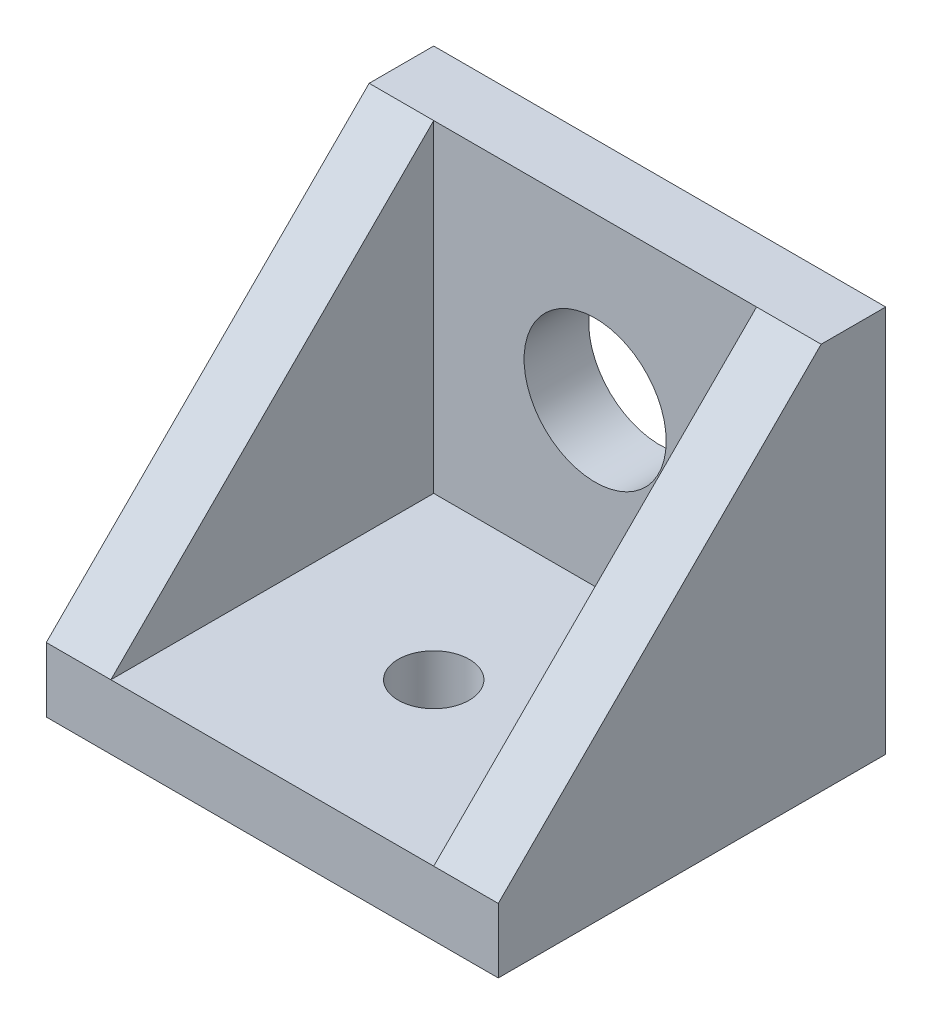
ISO-10303-21;
HEADER;
FILE_DESCRIPTION(('STEP AP214'),'2;1');
FILE_NAME('part.step','',(''),(''),'','','');
FILE_SCHEMA(('AUTOMOTIVE_DESIGN { 1 0 10303 214 1 1 1 1 }'));
ENDSEC;
DATA;
#1=APPLICATION_CONTEXT('core data for automotive mechanical design processes');
#2=APPLICATION_PROTOCOL_DEFINITION('international standard','automotive_design',2000,#1);
#3=PRODUCT_CONTEXT('',#1,'mechanical');
#4=PRODUCT('Part','Part','',(#3));
#5=PRODUCT_RELATED_PRODUCT_CATEGORY('part','',(#4));
#6=PRODUCT_DEFINITION_FORMATION('','',#4);
#7=PRODUCT_DEFINITION_CONTEXT('part definition',#1,'design');
#8=PRODUCT_DEFINITION('design','',#6,#7);
#9=PRODUCT_DEFINITION_SHAPE('','',#8);
#10=(LENGTH_UNIT() NAMED_UNIT(*) SI_UNIT(.MILLI.,.METRE.));
#11=(NAMED_UNIT(*) PLANE_ANGLE_UNIT() SI_UNIT($,.RADIAN.));
#12=(NAMED_UNIT(*) SI_UNIT($,.STERADIAN.) SOLID_ANGLE_UNIT());
#13=UNCERTAINTY_MEASURE_WITH_UNIT(LENGTH_MEASURE(1.E-05),#10,'distance_accuracy_value','');
#14=(GEOMETRIC_REPRESENTATION_CONTEXT(3) GLOBAL_UNCERTAINTY_ASSIGNED_CONTEXT((#13)) GLOBAL_UNIT_ASSIGNED_CONTEXT((#10,
#11,#12)) REPRESENTATION_CONTEXT('',''));
#15=CARTESIAN_POINT('',(0.,0.,0.));
#16=DIRECTION('',(0.,0.,1.));
#17=DIRECTION('',(1.,0.,0.));
#18=AXIS2_PLACEMENT_3D('',#15,#16,#17);
#19=CARTESIAN_POINT('',(0.,0.,3.));
#20=DIRECTION('',(0.,0.,-1.));
#21=DIRECTION('',(-1.,0.,0.));
#22=AXIS2_PLACEMENT_3D('',#19,#20,#21);
#23=PLANE('',#22);
#24=DIRECTION('',(0.,1.,0.));
#25=VECTOR('',#24,1.);
#26=CARTESIAN_POINT('',(7.5,-7.5,3.));
#27=LINE('',#26,#25);
#28=CARTESIAN_POINT('',(7.5,-7.5,3.));
#29=VERTEX_POINT('',#28);
#30=CARTESIAN_POINT('',(7.5,7.5,3.));
#31=VERTEX_POINT('',#30);
#32=EDGE_CURVE('E209',#29,#31,#27,.T.);
#33=ORIENTED_EDGE('',*,*,#32,.T.);
#34=DIRECTION('',(-1.,0.,0.));
#35=VECTOR('',#34,1.);
#36=CARTESIAN_POINT('',(-7.5,7.5,3.));
#37=LINE('',#36,#35);
#38=CARTESIAN_POINT('',(-7.5,7.5,3.));
#39=VERTEX_POINT('',#38);
#40=EDGE_CURVE('E63',#31,#39,#37,.T.);
#41=ORIENTED_EDGE('',*,*,#40,.T.);
#42=DIRECTION('',(0.,-1.,0.));
#43=VECTOR('',#42,1.);
#44=CARTESIAN_POINT('',(-7.5,-7.5,3.));
#45=LINE('',#44,#43);
#46=CARTESIAN_POINT('',(-7.5,-7.5,3.));
#47=VERTEX_POINT('',#46);
#48=EDGE_CURVE('E49',#39,#47,#45,.T.);
#49=ORIENTED_EDGE('',*,*,#48,.T.);
#50=DIRECTION('',(1.,0.,0.));
#51=VECTOR('',#50,1.);
#52=CARTESIAN_POINT('',(-7.5,-7.5,3.));
#53=LINE('',#52,#51);
#54=EDGE_CURVE('E11',#47,#29,#53,.T.);
#55=ORIENTED_EDGE('',*,*,#54,.T.);
#56=EDGE_LOOP('',(#33,#41,#49,#55));
#57=FACE_BOUND('',#56,.T.);
#58=CARTESIAN_POINT('',(0.,0.,3.));
#59=DIRECTION('',(0.,0.,1.));
#60=DIRECTION('',(1.,0.,0.));
#61=AXIS2_PLACEMENT_3D('',#58,#59,#60);
#62=CIRCLE('',#61,3.302);
#63=CARTESIAN_POINT('',(3.302,0.,3.));
#64=VERTEX_POINT('',#63);
#65=EDGE_CURVE('E202',#64,#64,#62,.T.);
#66=ORIENTED_EDGE('',*,*,#65,.F.);
#67=EDGE_LOOP('',(#66));
#68=FACE_BOUND('',#67,.T.);
#69=ADVANCED_FACE('F39',(#57,#68),#23,.F.);
#70=CARTESIAN_POINT('',(0.,0.,0.));
#71=DIRECTION('',(0.,0.,-1.));
#72=DIRECTION('',(-1.,0.,0.));
#73=AXIS2_PLACEMENT_3D('',#70,#71,#72);
#74=PLANE('',#73);
#75=DIRECTION('',(-1.,0.,0.));
#76=VECTOR('',#75,1.);
#77=CARTESIAN_POINT('',(-7.5,7.5,0.));
#78=LINE('',#77,#76);
#79=CARTESIAN_POINT('',(10.5,7.5,0.));
#80=VERTEX_POINT('',#79);
#81=CARTESIAN_POINT('',(-10.5,7.5,0.));
#82=VERTEX_POINT('',#81);
#83=EDGE_CURVE('E43',#80,#82,#78,.T.);
#84=ORIENTED_EDGE('',*,*,#83,.F.);
#85=DIRECTION('',(0.,1.,0.));
#86=VECTOR('',#85,1.);
#87=CARTESIAN_POINT('',(10.5,-10.5,0.));
#88=LINE('',#87,#86);
#89=CARTESIAN_POINT('',(10.5,-10.5,0.));
#90=VERTEX_POINT('',#89);
#91=EDGE_CURVE('E160',#90,#80,#88,.T.);
#92=ORIENTED_EDGE('',*,*,#91,.F.);
#93=DIRECTION('',(1.,0.,0.));
#94=VECTOR('',#93,1.);
#95=CARTESIAN_POINT('',(-7.5,-10.5,0.));
#96=LINE('',#95,#94);
#97=CARTESIAN_POINT('',(-10.5,-10.5,0.));
#98=VERTEX_POINT('',#97);
#99=EDGE_CURVE('E187',#98,#90,#96,.T.);
#100=ORIENTED_EDGE('',*,*,#99,.F.);
#101=DIRECTION('',(0.,1.,0.));
#102=VECTOR('',#101,1.);
#103=CARTESIAN_POINT('',(-10.5,-10.5,0.));
#104=LINE('',#103,#102);
#105=EDGE_CURVE('E133',#98,#82,#104,.T.);
#106=ORIENTED_EDGE('',*,*,#105,.T.);
#107=EDGE_LOOP('',(#84,#92,#100,#106));
#108=FACE_BOUND('',#107,.T.);
#109=CARTESIAN_POINT('',(0.,0.,0.));
#110=DIRECTION('',(0.,0.,1.));
#111=DIRECTION('',(1.,0.,0.));
#112=AXIS2_PLACEMENT_3D('',#109,#110,#111);
#113=CIRCLE('',#112,3.302);
#114=CARTESIAN_POINT('',(3.302,0.,0.));
#115=VERTEX_POINT('',#114);
#116=EDGE_CURVE('E194',#115,#115,#113,.T.);
#117=ORIENTED_EDGE('',*,*,#116,.T.);
#118=EDGE_LOOP('',(#117));
#119=FACE_BOUND('',#118,.T.);
#120=ADVANCED_FACE('F239',(#108,#119),#74,.T.);
#121=CARTESIAN_POINT('',(-7.5,7.5,3.));
#122=DIRECTION('',(0.,-1.,0.));
#123=DIRECTION('',(0.,0.,-1.));
#124=AXIS2_PLACEMENT_3D('',#121,#122,#123);
#125=PLANE('',#124);
#126=ORIENTED_EDGE('',*,*,#83,.T.);
#127=DIRECTION('',(0.,0.,1.));
#128=VECTOR('',#127,1.);
#129=CARTESIAN_POINT('',(-10.5,7.5,3.));
#130=LINE('',#129,#128);
#131=CARTESIAN_POINT('',(-10.5,7.5,3.));
#132=VERTEX_POINT('',#131);
#133=EDGE_CURVE('E124',#82,#132,#130,.T.);
#134=ORIENTED_EDGE('',*,*,#133,.T.);
#135=DIRECTION('',(1.,0.,0.));
#136=VECTOR('',#135,1.);
#137=CARTESIAN_POINT('',(-10.5,7.5,3.));
#138=LINE('',#137,#136);
#139=EDGE_CURVE('E108',#132,#39,#138,.T.);
#140=ORIENTED_EDGE('',*,*,#139,.T.);
#141=ORIENTED_EDGE('',*,*,#40,.F.);
#142=DIRECTION('',(-1.,0.,0.));
#143=VECTOR('',#142,1.);
#144=CARTESIAN_POINT('',(10.5,7.5,3.));
#145=LINE('',#144,#143);
#146=CARTESIAN_POINT('',(10.5,7.5,3.));
#147=VERTEX_POINT('',#146);
#148=EDGE_CURVE('E167',#147,#31,#145,.T.);
#149=ORIENTED_EDGE('',*,*,#148,.F.);
#150=DIRECTION('',(0.,0.,1.));
#151=VECTOR('',#150,1.);
#152=CARTESIAN_POINT('',(10.5,7.5,3.));
#153=LINE('',#152,#151);
#154=EDGE_CURVE('E164',#80,#147,#153,.T.);
#155=ORIENTED_EDGE('',*,*,#154,.F.);
#156=EDGE_LOOP('',(#126,#134,#140,#141,#149,#155));
#157=FACE_BOUND('',#156,.T.);
#158=ADVANCED_FACE('F41',(#157),#125,.F.);
#159=CARTESIAN_POINT('',(0.,0.,3.));
#160=DIRECTION('',(0.,0.,-1.));
#161=DIRECTION('',(-1.,0.,0.));
#162=AXIS2_PLACEMENT_3D('',#159,#160,#161);
#163=CYLINDRICAL_SURFACE('',#162,3.302);
#164=ORIENTED_EDGE('',*,*,#65,.T.);
#165=EDGE_LOOP('',(#164));
#166=FACE_BOUND('',#165,.T.);
#167=ORIENTED_EDGE('',*,*,#116,.F.);
#168=EDGE_LOOP('',(#167));
#169=FACE_BOUND('',#168,.T.);
#170=ADVANCED_FACE('F225',(#166,#169),#163,.F.);
#171=CARTESIAN_POINT('',(0.,-7.5,0.));
#172=DIRECTION('',(0.,1.,0.));
#173=DIRECTION('',(0.,0.,1.));
#174=AXIS2_PLACEMENT_3D('',#171,#172,#173);
#175=PLANE('',#174);
#176=CARTESIAN_POINT('',(0.,-7.5,10.5));
#177=DIRECTION('',(0.,-1.,0.));
#178=DIRECTION('',(0.,0.,-1.));
#179=AXIS2_PLACEMENT_3D('',#176,#177,#178);
#180=CIRCLE('',#179,1.65);
#181=CARTESIAN_POINT('',(0.,-7.5,8.85));
#182=VERTEX_POINT('',#181);
#183=EDGE_CURVE('E178',#182,#182,#180,.T.);
#184=ORIENTED_EDGE('',*,*,#183,.T.);
#185=EDGE_LOOP('',(#184));
#186=FACE_BOUND('',#185,.T.);
#187=ORIENTED_EDGE('',*,*,#54,.F.);
#188=DIRECTION('',(0.,0.,-1.));
#189=VECTOR('',#188,1.);
#190=CARTESIAN_POINT('',(-7.5,-7.5,0.));
#191=LINE('',#190,#189);
#192=CARTESIAN_POINT('',(-7.5,-7.5,18.));
#193=VERTEX_POINT('',#192);
#194=EDGE_CURVE('E183',#193,#47,#191,.T.);
#195=ORIENTED_EDGE('',*,*,#194,.F.);
#196=DIRECTION('',(-1.,0.,0.));
#197=VECTOR('',#196,1.);
#198=CARTESIAN_POINT('',(-7.5,-7.5,18.));
#199=LINE('',#198,#197);
#200=CARTESIAN_POINT('',(7.5,-7.5,18.));
#201=VERTEX_POINT('',#200);
#202=EDGE_CURVE('E191',#201,#193,#199,.T.);
#203=ORIENTED_EDGE('',*,*,#202,.F.);
#204=DIRECTION('',(0.,0.,1.));
#205=VECTOR('',#204,1.);
#206=CARTESIAN_POINT('',(7.50000000000001,-7.5,0.));
#207=LINE('',#206,#205);
#208=EDGE_CURVE('E56',#29,#201,#207,.T.);
#209=ORIENTED_EDGE('',*,*,#208,.F.);
#210=EDGE_LOOP('',(#187,#195,#203,#209));
#211=FACE_BOUND('',#210,.T.);
#212=ADVANCED_FACE('F222',(#186,#211),#175,.T.);
#213=CARTESIAN_POINT('',(0.,-10.5,0.));
#214=DIRECTION('',(0.,1.,0.));
#215=DIRECTION('',(0.,0.,1.));
#216=AXIS2_PLACEMENT_3D('',#213,#214,#215);
#217=PLANE('',#216);
#218=DIRECTION('',(-1.,0.,0.));
#219=VECTOR('',#218,1.);
#220=CARTESIAN_POINT('',(-7.5,-10.5,18.));
#221=LINE('',#220,#219);
#222=CARTESIAN_POINT('',(10.5,-10.5,18.));
#223=VERTEX_POINT('',#222);
#224=CARTESIAN_POINT('',(-10.5,-10.5,18.));
#225=VERTEX_POINT('',#224);
#226=EDGE_CURVE('E190',#223,#225,#221,.T.);
#227=ORIENTED_EDGE('',*,*,#226,.T.);
#228=DIRECTION('',(0.,0.,-1.));
#229=VECTOR('',#228,1.);
#230=CARTESIAN_POINT('',(-10.5,-10.5,0.));
#231=LINE('',#230,#229);
#232=EDGE_CURVE('E136',#225,#98,#231,.T.);
#233=ORIENTED_EDGE('',*,*,#232,.T.);
#234=ORIENTED_EDGE('',*,*,#99,.T.);
#235=DIRECTION('',(0.,0.,-1.));
#236=VECTOR('',#235,1.);
#237=CARTESIAN_POINT('',(10.5,-10.5,0.));
#238=LINE('',#237,#236);
#239=EDGE_CURVE('E156',#223,#90,#238,.T.);
#240=ORIENTED_EDGE('',*,*,#239,.F.);
#241=EDGE_LOOP('',(#227,#233,#234,#240));
#242=FACE_BOUND('',#241,.T.);
#243=CARTESIAN_POINT('',(0.,-10.5,10.5));
#244=DIRECTION('',(0.,-1.,0.));
#245=DIRECTION('',(0.,0.,-1.));
#246=AXIS2_PLACEMENT_3D('',#243,#244,#245);
#247=CIRCLE('',#246,1.65);
#248=CARTESIAN_POINT('',(0.,-10.5,8.85));
#249=VERTEX_POINT('',#248);
#250=EDGE_CURVE('E179',#249,#249,#247,.T.);
#251=ORIENTED_EDGE('',*,*,#250,.F.);
#252=EDGE_LOOP('',(#251));
#253=FACE_BOUND('',#252,.T.);
#254=ADVANCED_FACE('F224',(#242,#253),#217,.F.);
#255=CARTESIAN_POINT('',(-7.5,-10.5,18.));
#256=DIRECTION('',(0.,0.,-1.));
#257=DIRECTION('',(-1.,0.,0.));
#258=AXIS2_PLACEMENT_3D('',#255,#256,#257);
#259=PLANE('',#258);
#260=ORIENTED_EDGE('',*,*,#202,.T.);
#261=DIRECTION('',(1.,0.,0.));
#262=VECTOR('',#261,1.);
#263=CARTESIAN_POINT('',(-10.5,-7.5,18.));
#264=LINE('',#263,#262);
#265=CARTESIAN_POINT('',(-10.5,-7.5,18.));
#266=VERTEX_POINT('',#265);
#267=EDGE_CURVE('E118',#266,#193,#264,.T.);
#268=ORIENTED_EDGE('',*,*,#267,.F.);
#269=DIRECTION('',(0.,-1.,0.));
#270=VECTOR('',#269,1.);
#271=CARTESIAN_POINT('',(-10.5,-10.5,18.));
#272=LINE('',#271,#270);
#273=EDGE_CURVE('E128',#266,#225,#272,.T.);
#274=ORIENTED_EDGE('',*,*,#273,.T.);
#275=ORIENTED_EDGE('',*,*,#226,.F.);
#276=DIRECTION('',(0.,-1.,0.));
#277=VECTOR('',#276,1.);
#278=CARTESIAN_POINT('',(10.5,-10.5,18.));
#279=LINE('',#278,#277);
#280=CARTESIAN_POINT('',(10.5,-7.5,18.));
#281=VERTEX_POINT('',#280);
#282=EDGE_CURVE('E152',#281,#223,#279,.T.);
#283=ORIENTED_EDGE('',*,*,#282,.F.);
#284=DIRECTION('',(-1.,0.,0.));
#285=VECTOR('',#284,1.);
#286=CARTESIAN_POINT('',(10.5,-7.5,18.));
#287=LINE('',#286,#285);
#288=EDGE_CURVE('E174',#281,#201,#287,.T.);
#289=ORIENTED_EDGE('',*,*,#288,.T.);
#290=EDGE_LOOP('',(#260,#268,#274,#275,#283,#289));
#291=FACE_BOUND('',#290,.T.);
#292=ADVANCED_FACE('F232',(#291),#259,.F.);
#293=CARTESIAN_POINT('',(0.,-10.5,10.5));
#294=DIRECTION('',(0.,1.,0.));
#295=DIRECTION('',(0.,0.,1.));
#296=AXIS2_PLACEMENT_3D('',#293,#294,#295);
#297=CYLINDRICAL_SURFACE('',#296,1.65);
#298=ORIENTED_EDGE('',*,*,#250,.T.);
#299=EDGE_LOOP('',(#298));
#300=FACE_BOUND('',#299,.T.);
#301=ORIENTED_EDGE('',*,*,#183,.F.);
#302=EDGE_LOOP('',(#301));
#303=FACE_BOUND('',#302,.T.);
#304=ADVANCED_FACE('F246',(#300,#303),#297,.F.);
#305=CARTESIAN_POINT('',(7.5,0.,0.));
#306=DIRECTION('',(-1.,0.,0.));
#307=DIRECTION('',(0.,0.,1.));
#308=AXIS2_PLACEMENT_3D('',#305,#306,#307);
#309=PLANE('',#308);
#310=ORIENTED_EDGE('',*,*,#32,.F.);
#311=ORIENTED_EDGE('',*,*,#208,.T.);
#312=DIRECTION('',(0.,-0.707106781186547,0.707106781186548));
#313=VECTOR('',#312,1.);
#314=CARTESIAN_POINT('',(7.5,-7.5,18.));
#315=LINE('',#314,#313);
#316=EDGE_CURVE('E117',#31,#201,#315,.T.);
#317=ORIENTED_EDGE('',*,*,#316,.F.);
#318=EDGE_LOOP('',(#310,#311,#317));
#319=FACE_BOUND('',#318,.T.);
#320=ADVANCED_FACE('F251',(#319),#309,.T.);
#321=CARTESIAN_POINT('',(10.5,-7.5,18.));
#322=DIRECTION('',(0.,-0.707106781186548,-0.707106781186547));
#323=DIRECTION('',(0.,0.707106781186547,-0.707106781186548));
#324=AXIS2_PLACEMENT_3D('',#321,#322,#323);
#325=PLANE('',#324);
#326=ORIENTED_EDGE('',*,*,#316,.T.);
#327=ORIENTED_EDGE('',*,*,#288,.F.);
#328=DIRECTION('',(0.,-0.707106781186547,0.707106781186548));
#329=VECTOR('',#328,1.);
#330=CARTESIAN_POINT('',(10.5,-7.5,18.));
#331=LINE('',#330,#329);
#332=EDGE_CURVE('E148',#147,#281,#331,.T.);
#333=ORIENTED_EDGE('',*,*,#332,.F.);
#334=ORIENTED_EDGE('',*,*,#148,.T.);
#335=EDGE_LOOP('',(#326,#327,#333,#334));
#336=FACE_BOUND('',#335,.T.);
#337=ADVANCED_FACE('F259',(#336),#325,.F.);
#338=CARTESIAN_POINT('',(10.5,0.,0.));
#339=DIRECTION('',(-1.,0.,0.));
#340=DIRECTION('',(0.,0.,1.));
#341=AXIS2_PLACEMENT_3D('',#338,#339,#340);
#342=PLANE('',#341);
#343=ORIENTED_EDGE('',*,*,#332,.T.);
#344=ORIENTED_EDGE('',*,*,#282,.T.);
#345=ORIENTED_EDGE('',*,*,#239,.T.);
#346=ORIENTED_EDGE('',*,*,#91,.T.);
#347=ORIENTED_EDGE('',*,*,#154,.T.);
#348=EDGE_LOOP('',(#343,#344,#345,#346,#347));
#349=FACE_BOUND('',#348,.T.);
#350=ADVANCED_FACE('F261',(#349),#342,.F.);
#351=CARTESIAN_POINT('',(-10.5,-7.5,18.));
#352=DIRECTION('',(0.,0.707106781186548,0.707106781186547));
#353=DIRECTION('',(0.,-0.707106781186547,0.707106781186548));
#354=AXIS2_PLACEMENT_3D('',#351,#352,#353);
#355=PLANE('',#354);
#356=DIRECTION('',(0.,-0.707106781186547,0.707106781186548));
#357=VECTOR('',#356,1.);
#358=CARTESIAN_POINT('',(-7.5,-7.5,18.));
#359=LINE('',#358,#357);
#360=EDGE_CURVE('E114',#39,#193,#359,.T.);
#361=ORIENTED_EDGE('',*,*,#360,.F.);
#362=ORIENTED_EDGE('',*,*,#139,.F.);
#363=DIRECTION('',(0.,-0.707106781186547,0.707106781186548));
#364=VECTOR('',#363,1.);
#365=CARTESIAN_POINT('',(-10.5,-7.5,18.));
#366=LINE('',#365,#364);
#367=EDGE_CURVE('E111',#132,#266,#366,.T.);
#368=ORIENTED_EDGE('',*,*,#367,.T.);
#369=ORIENTED_EDGE('',*,*,#267,.T.);
#370=EDGE_LOOP('',(#361,#362,#368,#369));
#371=FACE_BOUND('',#370,.T.);
#372=ADVANCED_FACE('F110',(#371),#355,.T.);
#373=CARTESIAN_POINT('',(-10.5,0.,0.));
#374=DIRECTION('',(1.,0.,0.));
#375=DIRECTION('',(0.,0.,1.));
#376=AXIS2_PLACEMENT_3D('',#373,#374,#375);
#377=PLANE('',#376);
#378=ORIENTED_EDGE('',*,*,#367,.F.);
#379=ORIENTED_EDGE('',*,*,#133,.F.);
#380=ORIENTED_EDGE('',*,*,#105,.F.);
#381=ORIENTED_EDGE('',*,*,#232,.F.);
#382=ORIENTED_EDGE('',*,*,#273,.F.);
#383=EDGE_LOOP('',(#378,#379,#380,#381,#382));
#384=FACE_BOUND('',#383,.T.);
#385=ADVANCED_FACE('F122',(#384),#377,.F.);
#386=CARTESIAN_POINT('',(-7.5,0.,0.));
#387=DIRECTION('',(1.,0.,0.));
#388=DIRECTION('',(0.,0.,1.));
#389=AXIS2_PLACEMENT_3D('',#386,#387,#388);
#390=PLANE('',#389);
#391=ORIENTED_EDGE('',*,*,#360,.T.);
#392=ORIENTED_EDGE('',*,*,#194,.T.);
#393=ORIENTED_EDGE('',*,*,#48,.F.);
#394=EDGE_LOOP('',(#391,#392,#393));
#395=FACE_BOUND('',#394,.T.);
#396=ADVANCED_FACE('F220',(#395),#390,.T.);
#397=CLOSED_SHELL('',(#69,#120,#158,#170,#212,#254,#292,#304,#320,#337,#350,#372,#385,#396));
#398=MANIFOLD_SOLID_BREP('B2',#397);
#399=ADVANCED_BREP_SHAPE_REPRESENTATION('',(#18,#398),#14);
#400=SHAPE_DEFINITION_REPRESENTATION(#9,#399);
ENDSEC;
END-ISO-10303-21;
